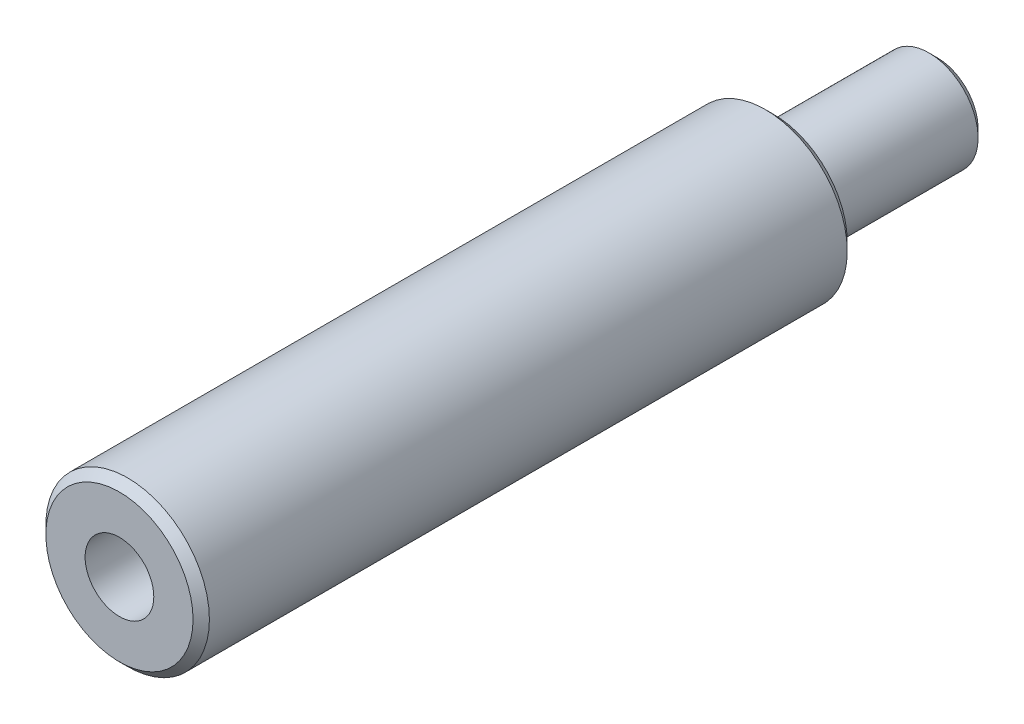
ISO-10303-21;
HEADER;
FILE_DESCRIPTION(('STEP AP214'),'2;1');
FILE_NAME('part.step','',(''),(''),'','','');
FILE_SCHEMA(('AUTOMOTIVE_DESIGN { 1 0 10303 214 1 1 1 1 }'));
ENDSEC;
DATA;
#1=APPLICATION_CONTEXT('core data for automotive mechanical design processes');
#2=APPLICATION_PROTOCOL_DEFINITION('international standard','automotive_design',2000,#1);
#3=PRODUCT_CONTEXT('',#1,'mechanical');
#4=PRODUCT('Part','Part','',(#3));
#5=PRODUCT_RELATED_PRODUCT_CATEGORY('part','',(#4));
#6=PRODUCT_DEFINITION_FORMATION('','',#4);
#7=PRODUCT_DEFINITION_CONTEXT('part definition',#1,'design');
#8=PRODUCT_DEFINITION('design','',#6,#7);
#9=PRODUCT_DEFINITION_SHAPE('','',#8);
#10=(LENGTH_UNIT() NAMED_UNIT(*) SI_UNIT(.MILLI.,.METRE.));
#11=(NAMED_UNIT(*) PLANE_ANGLE_UNIT() SI_UNIT($,.RADIAN.));
#12=(NAMED_UNIT(*) SI_UNIT($,.STERADIAN.) SOLID_ANGLE_UNIT());
#13=UNCERTAINTY_MEASURE_WITH_UNIT(LENGTH_MEASURE(1.E-05),#10,'distance_accuracy_value','');
#14=(GEOMETRIC_REPRESENTATION_CONTEXT(3) GLOBAL_UNCERTAINTY_ASSIGNED_CONTEXT((#13)) GLOBAL_UNIT_ASSIGNED_CONTEXT((#10,
#11,#12)) REPRESENTATION_CONTEXT('',''));
#15=CARTESIAN_POINT('',(0.,0.,0.));
#16=DIRECTION('',(0.,0.,1.));
#17=DIRECTION('',(1.,0.,0.));
#18=AXIS2_PLACEMENT_3D('',#15,#16,#17);
#19=CARTESIAN_POINT('',(0.,0.,40.));
#20=DIRECTION('',(0.,0.,-1.));
#21=DIRECTION('',(-1.,0.,0.));
#22=AXIS2_PLACEMENT_3D('',#19,#20,#21);
#23=CYLINDRICAL_SURFACE('',#22,5.);
#24=CARTESIAN_POINT('',(0.,0.,0.500000000000007));
#25=DIRECTION('',(0.,0.,1.));
#26=DIRECTION('',(1.,0.,0.));
#27=AXIS2_PLACEMENT_3D('',#24,#25,#26);
#28=CIRCLE('',#27,5.);
#29=CARTESIAN_POINT('',(5.,0.,0.500000000000007));
#30=VERTEX_POINT('',#29);
#31=EDGE_CURVE('E74',#30,#30,#28,.T.);
#32=ORIENTED_EDGE('',*,*,#31,.T.);
#33=EDGE_LOOP('',(#32));
#34=FACE_BOUND('',#33,.T.);
#35=CARTESIAN_POINT('',(0.,0.,39.5));
#36=DIRECTION('',(0.,0.,1.));
#37=DIRECTION('',(1.,0.,0.));
#38=AXIS2_PLACEMENT_3D('',#35,#36,#37);
#39=CIRCLE('',#38,5.);
#40=CARTESIAN_POINT('',(5.,0.,39.5));
#41=VERTEX_POINT('',#40);
#42=EDGE_CURVE('E71',#41,#41,#39,.F.);
#43=ORIENTED_EDGE('',*,*,#42,.T.);
#44=EDGE_LOOP('',(#43));
#45=FACE_BOUND('',#44,.T.);
#46=ADVANCED_FACE('F37',(#34,#45),#23,.T.);
#47=CARTESIAN_POINT('',(0.,0.,40.));
#48=DIRECTION('',(0.,0.,1.));
#49=DIRECTION('',(1.,0.,0.));
#50=AXIS2_PLACEMENT_3D('',#47,#48,#49);
#51=PLANE('',#50);
#52=CARTESIAN_POINT('',(0.,0.,40.));
#53=DIRECTION('',(0.,0.,1.));
#54=DIRECTION('',(1.,0.,0.));
#55=AXIS2_PLACEMENT_3D('',#52,#53,#54);
#56=CIRCLE('',#55,4.5);
#57=CARTESIAN_POINT('',(4.5,0.,40.));
#58=VERTEX_POINT('',#57);
#59=EDGE_CURVE('E11',#58,#58,#56,.T.);
#60=ORIENTED_EDGE('',*,*,#59,.T.);
#61=EDGE_LOOP('',(#60));
#62=FACE_BOUND('',#61,.T.);
#63=CARTESIAN_POINT('',(0.,0.,40.));
#64=DIRECTION('',(0.,0.,1.));
#65=DIRECTION('',(1.,0.,0.));
#66=AXIS2_PLACEMENT_3D('',#63,#64,#65);
#67=CIRCLE('',#66,2.1);
#68=CARTESIAN_POINT('',(2.1,0.,40.));
#69=VERTEX_POINT('',#68);
#70=EDGE_CURVE('E58',#69,#69,#67,.T.);
#71=ORIENTED_EDGE('',*,*,#70,.F.);
#72=EDGE_LOOP('',(#71));
#73=FACE_BOUND('',#72,.T.);
#74=ADVANCED_FACE('F90',(#62,#73),#51,.T.);
#75=CARTESIAN_POINT('',(0.,0.,0.));
#76=DIRECTION('',(0.,0.,1.));
#77=DIRECTION('',(1.,0.,0.));
#78=AXIS2_PLACEMENT_3D('',#75,#76,#77);
#79=PLANE('',#78);
#80=CARTESIAN_POINT('',(0.,0.,0.));
#81=DIRECTION('',(0.,0.,1.));
#82=DIRECTION('',(1.,0.,0.));
#83=AXIS2_PLACEMENT_3D('',#80,#81,#82);
#84=CIRCLE('',#83,4.49999999999999);
#85=CARTESIAN_POINT('',(4.49999999999999,0.,0.));
#86=VERTEX_POINT('',#85);
#87=EDGE_CURVE('E44',#86,#86,#84,.F.);
#88=ORIENTED_EDGE('',*,*,#87,.T.);
#89=EDGE_LOOP('',(#88));
#90=FACE_BOUND('',#89,.T.);
#91=CARTESIAN_POINT('',(0.,0.,0.));
#92=DIRECTION('',(0.,0.,-1.));
#93=DIRECTION('',(-1.,0.,0.));
#94=AXIS2_PLACEMENT_3D('',#91,#92,#93);
#95=CIRCLE('',#94,3.);
#96=CARTESIAN_POINT('',(-3.,0.,0.));
#97=VERTEX_POINT('',#96);
#98=EDGE_CURVE('E57',#97,#97,#95,.T.);
#99=ORIENTED_EDGE('',*,*,#98,.F.);
#100=EDGE_LOOP('',(#99));
#101=FACE_BOUND('',#100,.T.);
#102=ADVANCED_FACE('F79',(#90,#101),#79,.F.);
#103=CARTESIAN_POINT('',(0.,0.,-10.));
#104=DIRECTION('',(0.,0.,1.));
#105=DIRECTION('',(1.,0.,0.));
#106=AXIS2_PLACEMENT_3D('',#103,#104,#105);
#107=CYLINDRICAL_SURFACE('',#106,3.);
#108=CARTESIAN_POINT('',(0.,0.,-9.5));
#109=DIRECTION('',(0.,0.,-1.));
#110=DIRECTION('',(-1.,0.,0.));
#111=AXIS2_PLACEMENT_3D('',#108,#109,#110);
#112=CIRCLE('',#111,3.);
#113=CARTESIAN_POINT('',(-3.,0.,-9.5));
#114=VERTEX_POINT('',#113);
#115=EDGE_CURVE('E68',#114,#114,#112,.F.);
#116=ORIENTED_EDGE('',*,*,#115,.T.);
#117=EDGE_LOOP('',(#116));
#118=FACE_BOUND('',#117,.T.);
#119=ORIENTED_EDGE('',*,*,#98,.T.);
#120=EDGE_LOOP('',(#119));
#121=FACE_BOUND('',#120,.T.);
#122=ADVANCED_FACE('F113',(#118,#121),#107,.T.);
#123=CARTESIAN_POINT('',(0.,0.,-10.));
#124=DIRECTION('',(0.,0.,-1.));
#125=DIRECTION('',(-1.,0.,0.));
#126=AXIS2_PLACEMENT_3D('',#123,#124,#125);
#127=PLANE('',#126);
#128=CARTESIAN_POINT('',(0.,0.,-10.));
#129=DIRECTION('',(0.,0.,-1.));
#130=DIRECTION('',(-1.,0.,0.));
#131=AXIS2_PLACEMENT_3D('',#128,#129,#130);
#132=CIRCLE('',#131,2.5);
#133=CARTESIAN_POINT('',(-2.5,0.,-10.));
#134=VERTEX_POINT('',#133);
#135=EDGE_CURVE('E61',#134,#134,#132,.T.);
#136=ORIENTED_EDGE('',*,*,#135,.T.);
#137=EDGE_LOOP('',(#136));
#138=FACE_BOUND('',#137,.T.);
#139=ADVANCED_FACE('F51',(#138),#127,.T.);
#140=CARTESIAN_POINT('',(0.,0.,30.));
#141=DIRECTION('',(0.,0.,1.));
#142=DIRECTION('',(1.,0.,0.));
#143=AXIS2_PLACEMENT_3D('',#140,#141,#142);
#144=CONICAL_SURFACE('',#143,2.1,1.02974425867665);
#145=CARTESIAN_POINT('',(0.,0.,28.7381927000421));
#146=VERTEX_POINT('',#145);
#147=VERTEX_LOOP('',#146);
#148=FACE_BOUND('',#147,.T.);
#149=CARTESIAN_POINT('',(0.,0.,30.));
#150=DIRECTION('',(0.,0.,1.));
#151=DIRECTION('',(1.,0.,0.));
#152=AXIS2_PLACEMENT_3D('',#149,#150,#151);
#153=CIRCLE('',#152,2.1);
#154=CARTESIAN_POINT('',(2.1,0.,30.));
#155=VERTEX_POINT('',#154);
#156=EDGE_CURVE('E55',#155,#155,#153,.T.);
#157=ORIENTED_EDGE('',*,*,#156,.T.);
#158=EDGE_LOOP('',(#157));
#159=FACE_BOUND('',#158,.T.);
#160=ADVANCED_FACE('F47',(#148,#159),#144,.F.);
#161=CARTESIAN_POINT('',(0.,0.,40.));
#162=DIRECTION('',(0.,0.,1.));
#163=DIRECTION('',(1.,0.,0.));
#164=AXIS2_PLACEMENT_3D('',#161,#162,#163);
#165=CYLINDRICAL_SURFACE('',#164,2.1);
#166=ORIENTED_EDGE('',*,*,#156,.F.);
#167=EDGE_LOOP('',(#166));
#168=FACE_BOUND('',#167,.T.);
#169=ORIENTED_EDGE('',*,*,#70,.T.);
#170=EDGE_LOOP('',(#169));
#171=FACE_BOUND('',#170,.T.);
#172=ADVANCED_FACE('F50',(#168,#171),#165,.F.);
#173=CARTESIAN_POINT('',(0.,0.,-10.));
#174=DIRECTION('',(0.,0.,1.));
#175=DIRECTION('',(1.,0.,0.));
#176=AXIS2_PLACEMENT_3D('',#173,#174,#175);
#177=CONICAL_SURFACE('',#176,2.5,0.785398163397445);
#178=ORIENTED_EDGE('',*,*,#115,.F.);
#179=EDGE_LOOP('',(#178));
#180=FACE_BOUND('',#179,.T.);
#181=ORIENTED_EDGE('',*,*,#135,.F.);
#182=EDGE_LOOP('',(#181));
#183=FACE_BOUND('',#182,.T.);
#184=ADVANCED_FACE('F85',(#180,#183),#177,.T.);
#185=CARTESIAN_POINT('',(0.,0.,0.500000000000007));
#186=DIRECTION('',(0.,0.,1.));
#187=DIRECTION('',(1.,0.,0.));
#188=AXIS2_PLACEMENT_3D('',#185,#186,#187);
#189=CONICAL_SURFACE('',#188,5.,0.785398163397451);
#190=ORIENTED_EDGE('',*,*,#87,.F.);
#191=EDGE_LOOP('',(#190));
#192=FACE_BOUND('',#191,.T.);
#193=ORIENTED_EDGE('',*,*,#31,.F.);
#194=EDGE_LOOP('',(#193));
#195=FACE_BOUND('',#194,.T.);
#196=ADVANCED_FACE('F82',(#192,#195),#189,.T.);
#197=CARTESIAN_POINT('',(0.,0.,40.));
#198=DIRECTION('',(0.,0.,-1.));
#199=DIRECTION('',(-1.,0.,0.));
#200=AXIS2_PLACEMENT_3D('',#197,#198,#199);
#201=CONICAL_SURFACE('',#200,4.5,0.785398163397451);
#202=ORIENTED_EDGE('',*,*,#42,.F.);
#203=EDGE_LOOP('',(#202));
#204=FACE_BOUND('',#203,.T.);
#205=ORIENTED_EDGE('',*,*,#59,.F.);
#206=EDGE_LOOP('',(#205));
#207=FACE_BOUND('',#206,.T.);
#208=ADVANCED_FACE('F39',(#204,#207),#201,.T.);
#209=CLOSED_SHELL('',(#46,#74,#102,#122,#139,#160,#172,#184,#196,#208));
#210=MANIFOLD_SOLID_BREP('B2',#209);
#211=ADVANCED_BREP_SHAPE_REPRESENTATION('',(#18,#210),#14);
#212=SHAPE_DEFINITION_REPRESENTATION(#9,#211);
ENDSEC;
END-ISO-10303-21;
